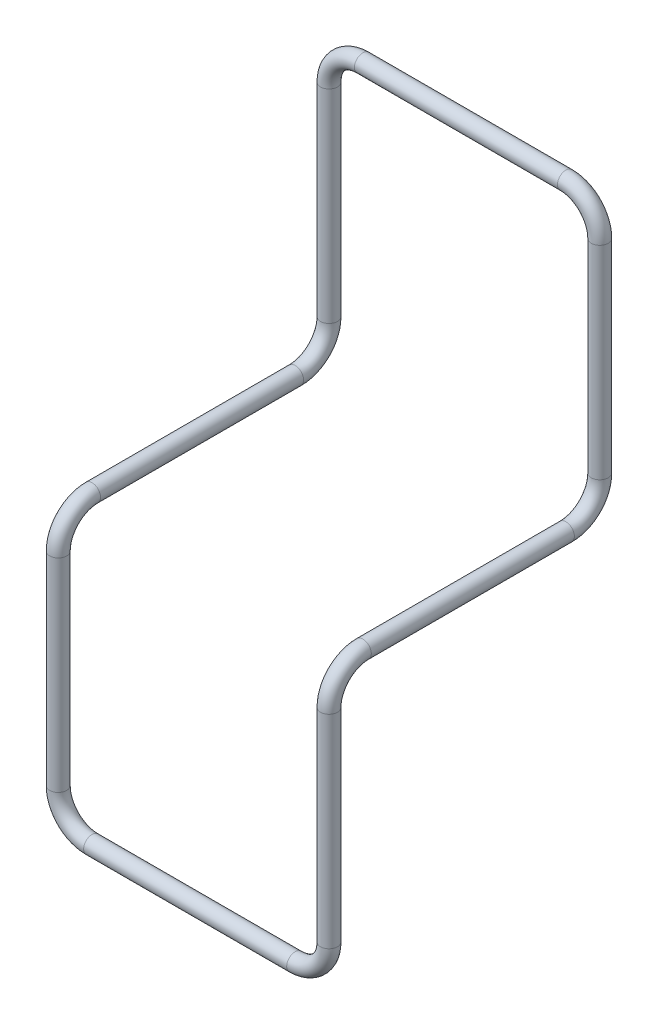
ISO-10303-21;
HEADER;
FILE_DESCRIPTION(('STEP AP214'),'2;1');
FILE_NAME('part.step','',(''),(''),'','','');
FILE_SCHEMA(('AUTOMOTIVE_DESIGN { 1 0 10303 214 1 1 1 1 }'));
ENDSEC;
DATA;
#1=APPLICATION_CONTEXT('core data for automotive mechanical design processes');
#2=APPLICATION_PROTOCOL_DEFINITION('international standard','automotive_design',2000,#1);
#3=PRODUCT_CONTEXT('',#1,'mechanical');
#4=PRODUCT('Part','Part','',(#3));
#5=PRODUCT_RELATED_PRODUCT_CATEGORY('part','',(#4));
#6=PRODUCT_DEFINITION_FORMATION('','',#4);
#7=PRODUCT_DEFINITION_CONTEXT('part definition',#1,'design');
#8=PRODUCT_DEFINITION('design','',#6,#7);
#9=PRODUCT_DEFINITION_SHAPE('','',#8);
#10=(LENGTH_UNIT() NAMED_UNIT(*) SI_UNIT(.MILLI.,.METRE.));
#11=(NAMED_UNIT(*) PLANE_ANGLE_UNIT() SI_UNIT($,.RADIAN.));
#12=(NAMED_UNIT(*) SI_UNIT($,.STERADIAN.) SOLID_ANGLE_UNIT());
#13=UNCERTAINTY_MEASURE_WITH_UNIT(LENGTH_MEASURE(1.E-05),#10,'distance_accuracy_value','');
#14=(GEOMETRIC_REPRESENTATION_CONTEXT(3) GLOBAL_UNCERTAINTY_ASSIGNED_CONTEXT((#13)) GLOBAL_UNIT_ASSIGNED_CONTEXT((#10,
#11,#12)) REPRESENTATION_CONTEXT('',''));
#15=CARTESIAN_POINT('',(0.,0.,0.));
#16=DIRECTION('',(0.,0.,1.));
#17=DIRECTION('',(1.,0.,0.));
#18=AXIS2_PLACEMENT_3D('',#15,#16,#17);
#19=CARTESIAN_POINT('',(6.35,-6.35,0.));
#20=DIRECTION('',(0.,0.,-1.));
#21=DIRECTION('',(-1.,0.,0.));
#22=AXIS2_PLACEMENT_3D('',#19,#20,#21);
#23=TOROIDAL_SURFACE('',#22,6.35,1.5875);
#24=CARTESIAN_POINT('',(0.,-6.35000000000001,0.));
#25=DIRECTION('',(0.,1.,0.));
#26=DIRECTION('',(0.,0.,-1.));
#27=AXIS2_PLACEMENT_3D('',#24,#25,#26);
#28=CIRCLE('',#27,1.5875);
#29=CARTESIAN_POINT('',(-1.5875,-6.35000000000002,0.));
#30=VERTEX_POINT('',#29);
#31=EDGE_CURVE('E10',#30,#30,#28,.T.);
#32=CARTESIAN_POINT('',(6.35,0.,0.));
#33=DIRECTION('',(1.,0.,0.));
#34=DIRECTION('',(0.,0.,-1.));
#35=AXIS2_PLACEMENT_3D('',#32,#33,#34);
#36=CIRCLE('',#35,1.5875);
#37=CARTESIAN_POINT('',(6.35,1.5875,0.));
#38=VERTEX_POINT('',#37);
#39=EDGE_CURVE('E110',#38,#38,#36,.T.);
#40=CARTESIAN_POINT('',(6.35,-6.35,0.));
#41=DIRECTION('',(0.,0.,-1.));
#42=DIRECTION('',(-1.,0.,0.));
#43=AXIS2_PLACEMENT_3D('',#40,#41,#42);
#44=CIRCLE('',#43,7.9375);
#45=EDGE_CURVE('',#30,#38,#44,.T.);
#46=ORIENTED_EDGE('',*,*,#31,.T.);
#47=ORIENTED_EDGE('',*,*,#39,.F.);
#48=ORIENTED_EDGE('',*,*,#45,.T.);
#49=ORIENTED_EDGE('',*,*,#45,.F.);
#50=EDGE_LOOP('',(#46,#48,#47,#49));
#51=FACE_BOUND('',#50,.T.);
#52=ADVANCED_FACE('F43',(#51),#23,.T.);
#53=CARTESIAN_POINT('',(0.,-44.45,0.));
#54=DIRECTION('',(0.,1.,0.));
#55=DIRECTION('',(0.,0.,1.));
#56=AXIS2_PLACEMENT_3D('',#53,#54,#55);
#57=CYLINDRICAL_SURFACE('',#56,1.5875);
#58=ORIENTED_EDGE('',*,*,#31,.F.);
#59=EDGE_LOOP('',(#58));
#60=FACE_BOUND('',#59,.T.);
#61=CARTESIAN_POINT('',(0.,-44.45,0.));
#62=DIRECTION('',(0.,1.,0.));
#63=DIRECTION('',(0.,0.,-1.));
#64=AXIS2_PLACEMENT_3D('',#61,#62,#63);
#65=CIRCLE('',#64,1.5875);
#66=CARTESIAN_POINT('',(0.,-44.45,-1.5875));
#67=VERTEX_POINT('',#66);
#68=EDGE_CURVE('E50',#67,#67,#65,.T.);
#69=ORIENTED_EDGE('',*,*,#68,.T.);
#70=EDGE_LOOP('',(#69));
#71=FACE_BOUND('',#70,.T.);
#72=ADVANCED_FACE('F118',(#60,#71),#57,.T.);
#73=CARTESIAN_POINT('',(0.,-44.45,6.35));
#74=DIRECTION('',(1.,0.,0.));
#75=DIRECTION('',(0.,0.,-1.));
#76=AXIS2_PLACEMENT_3D('',#73,#74,#75);
#77=TOROIDAL_SURFACE('',#76,6.35,1.5875);
#78=CARTESIAN_POINT('',(0.,-50.8,6.35000000000001));
#79=DIRECTION('',(0.,0.,-1.));
#80=DIRECTION('',(0.,-1.,0.));
#81=AXIS2_PLACEMENT_3D('',#78,#79,#80);
#82=CIRCLE('',#81,1.5875);
#83=CARTESIAN_POINT('',(0.,-52.3875,6.35000000000002));
#84=VERTEX_POINT('',#83);
#85=EDGE_CURVE('E55',#84,#84,#82,.T.);
#86=CARTESIAN_POINT('',(0.,-44.45,6.35));
#87=DIRECTION('',(1.,0.,0.));
#88=DIRECTION('',(0.,0.,-1.));
#89=AXIS2_PLACEMENT_3D('',#86,#87,#88);
#90=CIRCLE('',#89,7.9375);
#91=EDGE_CURVE('',#84,#67,#90,.T.);
#92=ORIENTED_EDGE('',*,*,#85,.T.);
#93=ORIENTED_EDGE('',*,*,#68,.F.);
#94=ORIENTED_EDGE('',*,*,#91,.T.);
#95=ORIENTED_EDGE('',*,*,#91,.F.);
#96=EDGE_LOOP('',(#92,#94,#93,#95));
#97=FACE_BOUND('',#96,.T.);
#98=ADVANCED_FACE('F122',(#97),#77,.T.);
#99=CARTESIAN_POINT('',(0.,-50.8,44.45));
#100=DIRECTION('',(0.,0.,-1.));
#101=DIRECTION('',(-1.,0.,0.));
#102=AXIS2_PLACEMENT_3D('',#99,#100,#101);
#103=CYLINDRICAL_SURFACE('',#102,1.5875);
#104=ORIENTED_EDGE('',*,*,#85,.F.);
#105=EDGE_LOOP('',(#104));
#106=FACE_BOUND('',#105,.T.);
#107=CARTESIAN_POINT('',(0.,-50.8,44.45));
#108=DIRECTION('',(0.,0.,-1.));
#109=DIRECTION('',(0.,-1.,0.));
#110=AXIS2_PLACEMENT_3D('',#107,#108,#109);
#111=CIRCLE('',#110,1.5875);
#112=CARTESIAN_POINT('',(0.,-49.2125,44.45));
#113=VERTEX_POINT('',#112);
#114=EDGE_CURVE('E60',#113,#113,#111,.T.);
#115=ORIENTED_EDGE('',*,*,#114,.T.);
#116=EDGE_LOOP('',(#115));
#117=FACE_BOUND('',#116,.T.);
#118=ADVANCED_FACE('F127',(#106,#117),#103,.T.);
#119=CARTESIAN_POINT('',(0.,-57.15,44.45));
#120=DIRECTION('',(-1.,0.,0.));
#121=DIRECTION('',(0.,0.,1.));
#122=AXIS2_PLACEMENT_3D('',#119,#120,#121);
#123=TOROIDAL_SURFACE('',#122,6.35,1.5875);
#124=CARTESIAN_POINT('',(0.,-57.15,50.8));
#125=DIRECTION('',(0.,1.,0.));
#126=DIRECTION('',(0.,0.,-1.));
#127=AXIS2_PLACEMENT_3D('',#124,#125,#126);
#128=CIRCLE('',#127,1.5875);
#129=CARTESIAN_POINT('',(0.,-57.15,52.3875));
#130=VERTEX_POINT('',#129);
#131=EDGE_CURVE('E66',#130,#130,#128,.T.);
#132=CARTESIAN_POINT('',(0.,-57.15,44.45));
#133=DIRECTION('',(-1.,0.,0.));
#134=DIRECTION('',(0.,0.,1.));
#135=AXIS2_PLACEMENT_3D('',#132,#133,#134);
#136=CIRCLE('',#135,7.9375);
#137=EDGE_CURVE('',#130,#113,#136,.T.);
#138=ORIENTED_EDGE('',*,*,#131,.T.);
#139=ORIENTED_EDGE('',*,*,#114,.F.);
#140=ORIENTED_EDGE('',*,*,#137,.T.);
#141=ORIENTED_EDGE('',*,*,#137,.F.);
#142=EDGE_LOOP('',(#138,#140,#139,#141));
#143=FACE_BOUND('',#142,.T.);
#144=ADVANCED_FACE('F133',(#143),#123,.T.);
#145=CARTESIAN_POINT('',(0.,-95.25,50.8));
#146=DIRECTION('',(0.,1.,0.));
#147=DIRECTION('',(0.,0.,1.));
#148=AXIS2_PLACEMENT_3D('',#145,#146,#147);
#149=CYLINDRICAL_SURFACE('',#148,1.5875);
#150=ORIENTED_EDGE('',*,*,#131,.F.);
#151=EDGE_LOOP('',(#150));
#152=FACE_BOUND('',#151,.T.);
#153=CARTESIAN_POINT('',(0.,-95.25,50.8));
#154=DIRECTION('',(0.,1.,0.));
#155=DIRECTION('',(0.,0.,-1.));
#156=AXIS2_PLACEMENT_3D('',#153,#154,#155);
#157=CIRCLE('',#156,1.5875);
#158=CARTESIAN_POINT('',(-1.58749999999998,-95.25,50.8));
#159=VERTEX_POINT('',#158);
#160=EDGE_CURVE('E70',#159,#159,#157,.T.);
#161=ORIENTED_EDGE('',*,*,#160,.T.);
#162=EDGE_LOOP('',(#161));
#163=FACE_BOUND('',#162,.T.);
#164=ADVANCED_FACE('F137',(#152,#163),#149,.T.);
#165=CARTESIAN_POINT('',(6.35000000000001,-95.25,50.8));
#166=DIRECTION('',(0.,0.,-1.));
#167=DIRECTION('',(-1.,0.,0.));
#168=AXIS2_PLACEMENT_3D('',#165,#166,#167);
#169=TOROIDAL_SURFACE('',#168,6.34999999999999,1.5875);
#170=CARTESIAN_POINT('',(6.35000000000002,-101.6,50.8));
#171=DIRECTION('',(-1.,0.,0.));
#172=DIRECTION('',(0.,0.,-1.));
#173=AXIS2_PLACEMENT_3D('',#170,#171,#172);
#174=CIRCLE('',#173,1.5875);
#175=CARTESIAN_POINT('',(6.35000000000002,-103.1875,50.8));
#176=VERTEX_POINT('',#175);
#177=EDGE_CURVE('E74',#176,#176,#174,.T.);
#178=CARTESIAN_POINT('',(6.35000000000001,-95.25,50.8));
#179=DIRECTION('',(0.,0.,-1.));
#180=DIRECTION('',(-1.,0.,0.));
#181=AXIS2_PLACEMENT_3D('',#178,#179,#180);
#182=CIRCLE('',#181,7.93749999999999);
#183=EDGE_CURVE('',#176,#159,#182,.T.);
#184=ORIENTED_EDGE('',*,*,#177,.T.);
#185=ORIENTED_EDGE('',*,*,#160,.F.);
#186=ORIENTED_EDGE('',*,*,#183,.T.);
#187=ORIENTED_EDGE('',*,*,#183,.F.);
#188=EDGE_LOOP('',(#184,#186,#185,#187));
#189=FACE_BOUND('',#188,.T.);
#190=ADVANCED_FACE('F141',(#189),#169,.T.);
#191=CARTESIAN_POINT('',(44.45,-101.6,50.8));
#192=DIRECTION('',(-1.,0.,0.));
#193=DIRECTION('',(0.,0.,1.));
#194=AXIS2_PLACEMENT_3D('',#191,#192,#193);
#195=CYLINDRICAL_SURFACE('',#194,1.5875);
#196=ORIENTED_EDGE('',*,*,#177,.F.);
#197=EDGE_LOOP('',(#196));
#198=FACE_BOUND('',#197,.T.);
#199=CARTESIAN_POINT('',(44.45,-101.6,50.8));
#200=DIRECTION('',(-1.,0.,0.));
#201=DIRECTION('',(0.,0.,-1.));
#202=AXIS2_PLACEMENT_3D('',#199,#200,#201);
#203=CIRCLE('',#202,1.5875);
#204=CARTESIAN_POINT('',(44.45,-103.1875,50.8));
#205=VERTEX_POINT('',#204);
#206=EDGE_CURVE('E78',#205,#205,#203,.T.);
#207=ORIENTED_EDGE('',*,*,#206,.T.);
#208=EDGE_LOOP('',(#207));
#209=FACE_BOUND('',#208,.T.);
#210=ADVANCED_FACE('F145',(#198,#209),#195,.T.);
#211=CARTESIAN_POINT('',(44.45,-95.25,50.8));
#212=DIRECTION('',(0.,0.,-1.));
#213=DIRECTION('',(-1.,0.,0.));
#214=AXIS2_PLACEMENT_3D('',#211,#212,#213);
#215=TOROIDAL_SURFACE('',#214,6.34999999999999,1.5875);
#216=CARTESIAN_POINT('',(50.8,-95.25,50.8));
#217=DIRECTION('',(0.,-1.,0.));
#218=DIRECTION('',(0.,0.,-1.));
#219=AXIS2_PLACEMENT_3D('',#216,#217,#218);
#220=CIRCLE('',#219,1.5875);
#221=CARTESIAN_POINT('',(52.3875,-95.25,50.8));
#222=VERTEX_POINT('',#221);
#223=EDGE_CURVE('E82',#222,#222,#220,.T.);
#224=CARTESIAN_POINT('',(44.45,-95.25,50.8));
#225=DIRECTION('',(0.,0.,-1.));
#226=DIRECTION('',(-1.,0.,0.));
#227=AXIS2_PLACEMENT_3D('',#224,#225,#226);
#228=CIRCLE('',#227,7.93749999999999);
#229=EDGE_CURVE('',#222,#205,#228,.T.);
#230=ORIENTED_EDGE('',*,*,#223,.T.);
#231=ORIENTED_EDGE('',*,*,#206,.F.);
#232=ORIENTED_EDGE('',*,*,#229,.T.);
#233=ORIENTED_EDGE('',*,*,#229,.F.);
#234=EDGE_LOOP('',(#230,#232,#231,#233));
#235=FACE_BOUND('',#234,.T.);
#236=ADVANCED_FACE('F149',(#235),#215,.T.);
#237=CARTESIAN_POINT('',(50.8,-57.15,50.8));
#238=DIRECTION('',(0.,-1.,0.));
#239=DIRECTION('',(1.,0.,0.));
#240=AXIS2_PLACEMENT_3D('',#237,#238,#239);
#241=CYLINDRICAL_SURFACE('',#240,1.5875);
#242=ORIENTED_EDGE('',*,*,#223,.F.);
#243=EDGE_LOOP('',(#242));
#244=FACE_BOUND('',#243,.T.);
#245=CARTESIAN_POINT('',(50.8,-57.15,50.8));
#246=DIRECTION('',(0.,-1.,0.));
#247=DIRECTION('',(0.,0.,-1.));
#248=AXIS2_PLACEMENT_3D('',#245,#246,#247);
#249=CIRCLE('',#248,1.5875);
#250=CARTESIAN_POINT('',(50.8,-57.15,52.3875));
#251=VERTEX_POINT('',#250);
#252=EDGE_CURVE('E86',#251,#251,#249,.T.);
#253=ORIENTED_EDGE('',*,*,#252,.T.);
#254=EDGE_LOOP('',(#253));
#255=FACE_BOUND('',#254,.T.);
#256=ADVANCED_FACE('F153',(#244,#255),#241,.T.);
#257=CARTESIAN_POINT('',(50.8,-57.15,44.45));
#258=DIRECTION('',(1.,0.,0.));
#259=DIRECTION('',(0.,0.,-1.));
#260=AXIS2_PLACEMENT_3D('',#257,#258,#259);
#261=TOROIDAL_SURFACE('',#260,6.35,1.5875);
#262=CARTESIAN_POINT('',(50.8,-50.8,44.45));
#263=DIRECTION('',(0.,0.,1.));
#264=DIRECTION('',(0.,-1.,0.));
#265=AXIS2_PLACEMENT_3D('',#262,#263,#264);
#266=CIRCLE('',#265,1.5875);
#267=CARTESIAN_POINT('',(50.8,-49.2125,44.45));
#268=VERTEX_POINT('',#267);
#269=EDGE_CURVE('E90',#268,#268,#266,.T.);
#270=CARTESIAN_POINT('',(50.8,-57.15,44.45));
#271=DIRECTION('',(1.,0.,0.));
#272=DIRECTION('',(0.,0.,-1.));
#273=AXIS2_PLACEMENT_3D('',#270,#271,#272);
#274=CIRCLE('',#273,7.9375);
#275=EDGE_CURVE('',#268,#251,#274,.T.);
#276=ORIENTED_EDGE('',*,*,#269,.T.);
#277=ORIENTED_EDGE('',*,*,#252,.F.);
#278=ORIENTED_EDGE('',*,*,#275,.T.);
#279=ORIENTED_EDGE('',*,*,#275,.F.);
#280=EDGE_LOOP('',(#276,#278,#277,#279));
#281=FACE_BOUND('',#280,.T.);
#282=ADVANCED_FACE('F157',(#281),#261,.T.);
#283=CARTESIAN_POINT('',(50.8,-50.8,6.34999999999999));
#284=DIRECTION('',(0.,0.,1.));
#285=DIRECTION('',(1.,0.,0.));
#286=AXIS2_PLACEMENT_3D('',#283,#284,#285);
#287=CYLINDRICAL_SURFACE('',#286,1.5875);
#288=ORIENTED_EDGE('',*,*,#269,.F.);
#289=EDGE_LOOP('',(#288));
#290=FACE_BOUND('',#289,.T.);
#291=CARTESIAN_POINT('',(50.8,-50.8,6.34999999999999));
#292=DIRECTION('',(0.,0.,1.));
#293=DIRECTION('',(0.,-1.,0.));
#294=AXIS2_PLACEMENT_3D('',#291,#292,#293);
#295=CIRCLE('',#294,1.5875);
#296=CARTESIAN_POINT('',(50.8,-52.3875,6.34999999999999));
#297=VERTEX_POINT('',#296);
#298=EDGE_CURVE('E94',#297,#297,#295,.T.);
#299=ORIENTED_EDGE('',*,*,#298,.T.);
#300=EDGE_LOOP('',(#299));
#301=FACE_BOUND('',#300,.T.);
#302=ADVANCED_FACE('F161',(#290,#301),#287,.T.);
#303=CARTESIAN_POINT('',(50.8,-44.45,6.35));
#304=DIRECTION('',(-1.,0.,0.));
#305=DIRECTION('',(0.,0.,1.));
#306=AXIS2_PLACEMENT_3D('',#303,#304,#305);
#307=TOROIDAL_SURFACE('',#306,6.35,1.5875);
#308=CARTESIAN_POINT('',(50.8,-44.45,0.));
#309=DIRECTION('',(0.,-1.,0.));
#310=DIRECTION('',(0.,0.,-1.));
#311=AXIS2_PLACEMENT_3D('',#308,#309,#310);
#312=CIRCLE('',#311,1.5875);
#313=CARTESIAN_POINT('',(50.8,-44.45,-1.5875));
#314=VERTEX_POINT('',#313);
#315=EDGE_CURVE('E98',#314,#314,#312,.T.);
#316=CARTESIAN_POINT('',(50.8,-44.45,6.35));
#317=DIRECTION('',(-1.,0.,0.));
#318=DIRECTION('',(0.,0.,1.));
#319=AXIS2_PLACEMENT_3D('',#316,#317,#318);
#320=CIRCLE('',#319,7.9375);
#321=EDGE_CURVE('',#314,#297,#320,.T.);
#322=ORIENTED_EDGE('',*,*,#315,.T.);
#323=ORIENTED_EDGE('',*,*,#298,.F.);
#324=ORIENTED_EDGE('',*,*,#321,.T.);
#325=ORIENTED_EDGE('',*,*,#321,.F.);
#326=EDGE_LOOP('',(#322,#324,#323,#325));
#327=FACE_BOUND('',#326,.T.);
#328=ADVANCED_FACE('F165',(#327),#307,.T.);
#329=CARTESIAN_POINT('',(50.8,-6.34999999999998,0.));
#330=DIRECTION('',(0.,-1.,0.));
#331=DIRECTION('',(1.,0.,0.));
#332=AXIS2_PLACEMENT_3D('',#329,#330,#331);
#333=CYLINDRICAL_SURFACE('',#332,1.5875);
#334=ORIENTED_EDGE('',*,*,#315,.F.);
#335=EDGE_LOOP('',(#334));
#336=FACE_BOUND('',#335,.T.);
#337=CARTESIAN_POINT('',(50.8,-6.34999999999998,0.));
#338=DIRECTION('',(0.,-1.,0.));
#339=DIRECTION('',(0.,0.,-1.));
#340=AXIS2_PLACEMENT_3D('',#337,#338,#339);
#341=CIRCLE('',#340,1.5875);
#342=CARTESIAN_POINT('',(52.3875,-6.34999999999998,0.));
#343=VERTEX_POINT('',#342);
#344=EDGE_CURVE('E102',#343,#343,#341,.T.);
#345=ORIENTED_EDGE('',*,*,#344,.T.);
#346=EDGE_LOOP('',(#345));
#347=FACE_BOUND('',#346,.T.);
#348=ADVANCED_FACE('F169',(#336,#347),#333,.T.);
#349=CARTESIAN_POINT('',(44.45,-6.35,0.));
#350=DIRECTION('',(0.,0.,-1.));
#351=DIRECTION('',(-1.,0.,0.));
#352=AXIS2_PLACEMENT_3D('',#349,#350,#351);
#353=TOROIDAL_SURFACE('',#352,6.35,1.5875);
#354=CARTESIAN_POINT('',(44.45,0.,0.));
#355=DIRECTION('',(1.,0.,0.));
#356=DIRECTION('',(0.,0.,-1.));
#357=AXIS2_PLACEMENT_3D('',#354,#355,#356);
#358=CIRCLE('',#357,1.5875);
#359=CARTESIAN_POINT('',(44.45,1.5875,0.));
#360=VERTEX_POINT('',#359);
#361=EDGE_CURVE('E106',#360,#360,#358,.T.);
#362=CARTESIAN_POINT('',(44.45,-6.35,0.));
#363=DIRECTION('',(0.,0.,-1.));
#364=DIRECTION('',(-1.,0.,0.));
#365=AXIS2_PLACEMENT_3D('',#362,#363,#364);
#366=CIRCLE('',#365,7.9375);
#367=EDGE_CURVE('',#360,#343,#366,.T.);
#368=ORIENTED_EDGE('',*,*,#361,.T.);
#369=ORIENTED_EDGE('',*,*,#344,.F.);
#370=ORIENTED_EDGE('',*,*,#367,.T.);
#371=ORIENTED_EDGE('',*,*,#367,.F.);
#372=EDGE_LOOP('',(#368,#370,#369,#371));
#373=FACE_BOUND('',#372,.T.);
#374=ADVANCED_FACE('F173',(#373),#353,.T.);
#375=CARTESIAN_POINT('',(6.35,0.,0.));
#376=DIRECTION('',(1.,0.,0.));
#377=DIRECTION('',(0.,0.,-1.));
#378=AXIS2_PLACEMENT_3D('',#375,#376,#377);
#379=CYLINDRICAL_SURFACE('',#378,1.5875);
#380=ORIENTED_EDGE('',*,*,#361,.F.);
#381=EDGE_LOOP('',(#380));
#382=FACE_BOUND('',#381,.T.);
#383=ORIENTED_EDGE('',*,*,#39,.T.);
#384=EDGE_LOOP('',(#383));
#385=FACE_BOUND('',#384,.T.);
#386=ADVANCED_FACE('F115',(#382,#385),#379,.T.);
#387=CLOSED_SHELL('',(#52,#72,#98,#118,#144,#164,#190,#210,#236,#256,#282,#302,#328,#348,#374,#386));
#388=MANIFOLD_SOLID_BREP('B2',#387);
#389=ADVANCED_BREP_SHAPE_REPRESENTATION('',(#18,#388),#14);
#390=SHAPE_DEFINITION_REPRESENTATION(#9,#389);
ENDSEC;
END-ISO-10303-21;
